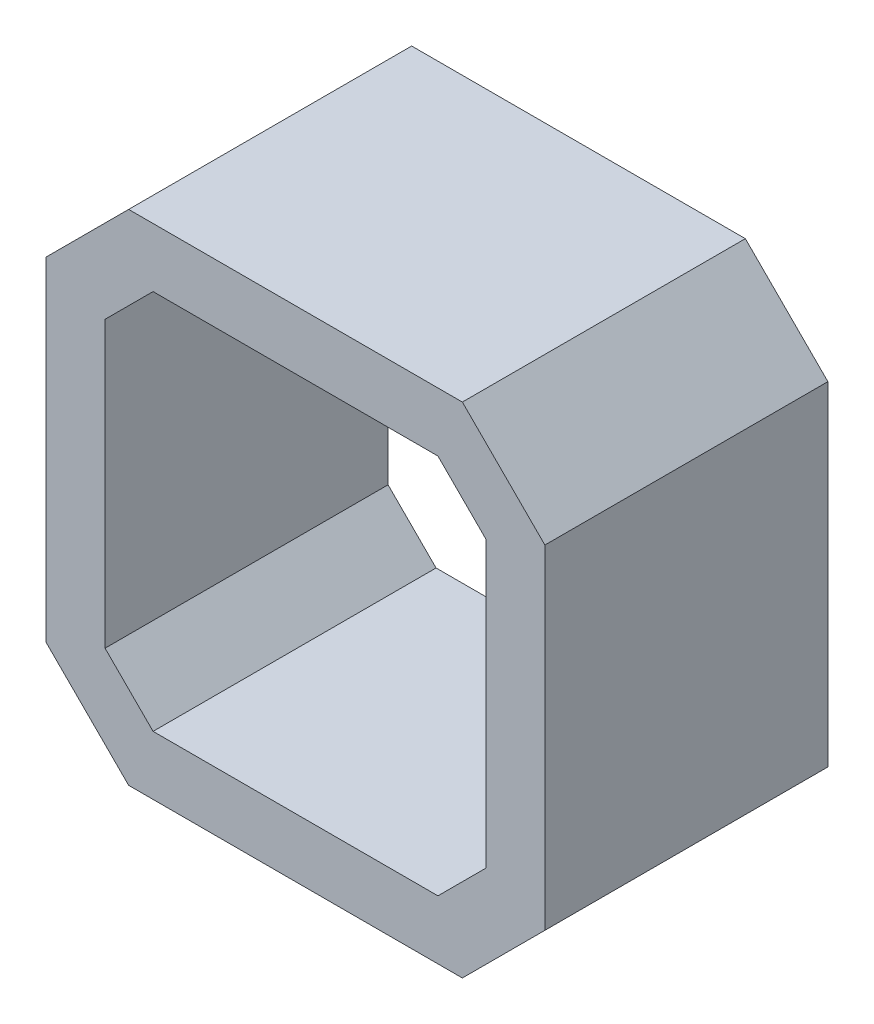
ISO-10303-21;
HEADER;
FILE_DESCRIPTION(('STEP AP214'),'2;1');
FILE_NAME('part.step','',(''),(''),'','','');
FILE_SCHEMA(('AUTOMOTIVE_DESIGN { 1 0 10303 214 1 1 1 1 }'));
ENDSEC;
DATA;
#1=APPLICATION_CONTEXT('core data for automotive mechanical design processes');
#2=APPLICATION_PROTOCOL_DEFINITION('international standard','automotive_design',2000,#1);
#3=PRODUCT_CONTEXT('',#1,'mechanical');
#4=PRODUCT('Part','Part','',(#3));
#5=PRODUCT_RELATED_PRODUCT_CATEGORY('part','',(#4));
#6=PRODUCT_DEFINITION_FORMATION('','',#4);
#7=PRODUCT_DEFINITION_CONTEXT('part definition',#1,'design');
#8=PRODUCT_DEFINITION('design','',#6,#7);
#9=PRODUCT_DEFINITION_SHAPE('','',#8);
#10=(LENGTH_UNIT() NAMED_UNIT(*) SI_UNIT(.MILLI.,.METRE.));
#11=(NAMED_UNIT(*) PLANE_ANGLE_UNIT() SI_UNIT($,.RADIAN.));
#12=(NAMED_UNIT(*) SI_UNIT($,.STERADIAN.) SOLID_ANGLE_UNIT());
#13=UNCERTAINTY_MEASURE_WITH_UNIT(LENGTH_MEASURE(1.E-05),#10,'distance_accuracy_value','');
#14=(GEOMETRIC_REPRESENTATION_CONTEXT(3) GLOBAL_UNCERTAINTY_ASSIGNED_CONTEXT((#13)) GLOBAL_UNIT_ASSIGNED_CONTEXT((#10,
#11,#12)) REPRESENTATION_CONTEXT('',''));
#15=CARTESIAN_POINT('',(0.,0.,0.));
#16=DIRECTION('',(0.,0.,1.));
#17=DIRECTION('',(1.,0.,0.));
#18=AXIS2_PLACEMENT_3D('',#15,#16,#17);
#19=CARTESIAN_POINT('',(0.,0.,48.));
#20=DIRECTION('',(0.,0.,-1.));
#21=DIRECTION('',(-1.,0.,0.));
#22=AXIS2_PLACEMENT_3D('',#19,#20,#21);
#23=PLANE('',#22);
#24=DIRECTION('',(0.,-1.,0.));
#25=VECTOR('',#24,1.);
#26=CARTESIAN_POINT('',(-42.3,-28.3,48.));
#27=LINE('',#26,#25);
#28=CARTESIAN_POINT('',(-42.3,28.3,48.));
#29=VERTEX_POINT('',#28);
#30=CARTESIAN_POINT('',(-42.3,-28.3,48.));
#31=VERTEX_POINT('',#30);
#32=EDGE_CURVE('E212',#29,#31,#27,.T.);
#33=ORIENTED_EDGE('',*,*,#32,.T.);
#34=DIRECTION('',(0.707106781186547,-0.707106781186547,0.));
#35=VECTOR('',#34,1.);
#36=CARTESIAN_POINT('',(-42.3,-28.3,48.));
#37=LINE('',#36,#35);
#38=CARTESIAN_POINT('',(-28.3,-42.3,48.));
#39=VERTEX_POINT('',#38);
#40=EDGE_CURVE('E215',#31,#39,#37,.T.);
#41=ORIENTED_EDGE('',*,*,#40,.T.);
#42=DIRECTION('',(1.,0.,0.));
#43=VECTOR('',#42,1.);
#44=CARTESIAN_POINT('',(-28.3,-42.3,48.));
#45=LINE('',#44,#43);
#46=CARTESIAN_POINT('',(28.3,-42.3,48.));
#47=VERTEX_POINT('',#46);
#48=EDGE_CURVE('E218',#39,#47,#45,.T.);
#49=ORIENTED_EDGE('',*,*,#48,.T.);
#50=DIRECTION('',(0.707106781186547,0.707106781186547,0.));
#51=VECTOR('',#50,1.);
#52=CARTESIAN_POINT('',(28.3,-42.3,48.));
#53=LINE('',#52,#51);
#54=CARTESIAN_POINT('',(42.3,-28.3,48.));
#55=VERTEX_POINT('',#54);
#56=EDGE_CURVE('E220',#47,#55,#53,.T.);
#57=ORIENTED_EDGE('',*,*,#56,.T.);
#58=DIRECTION('',(0.,1.,0.));
#59=VECTOR('',#58,1.);
#60=CARTESIAN_POINT('',(42.3,-28.3,48.));
#61=LINE('',#60,#59);
#62=CARTESIAN_POINT('',(42.3,28.3,48.));
#63=VERTEX_POINT('',#62);
#64=EDGE_CURVE('E222',#55,#63,#61,.T.);
#65=ORIENTED_EDGE('',*,*,#64,.T.);
#66=DIRECTION('',(-0.707106781186547,0.707106781186547,0.));
#67=VECTOR('',#66,1.);
#68=CARTESIAN_POINT('',(28.3,42.3,48.));
#69=LINE('',#68,#67);
#70=CARTESIAN_POINT('',(28.3,42.3,48.));
#71=VERTEX_POINT('',#70);
#72=EDGE_CURVE('E224',#63,#71,#69,.T.);
#73=ORIENTED_EDGE('',*,*,#72,.T.);
#74=DIRECTION('',(-1.,0.,0.));
#75=VECTOR('',#74,1.);
#76=CARTESIAN_POINT('',(-28.3,42.3,48.));
#77=LINE('',#76,#75);
#78=CARTESIAN_POINT('',(-28.3,42.3,48.));
#79=VERTEX_POINT('',#78);
#80=EDGE_CURVE('E226',#71,#79,#77,.T.);
#81=ORIENTED_EDGE('',*,*,#80,.T.);
#82=DIRECTION('',(-0.707106781186547,-0.707106781186547,0.));
#83=VECTOR('',#82,1.);
#84=CARTESIAN_POINT('',(-42.3,28.3,48.));
#85=LINE('',#84,#83);
#86=EDGE_CURVE('E228',#79,#29,#85,.T.);
#87=ORIENTED_EDGE('',*,*,#86,.T.);
#88=EDGE_LOOP('',(#33,#41,#49,#57,#65,#73,#81,#87));
#89=FACE_BOUND('',#88,.T.);
#90=DIRECTION('',(-0.707106781186547,-0.707106781186547,0.));
#91=VECTOR('',#90,1.);
#92=CARTESIAN_POINT('',(-32.3,24.157864376269,48.));
#93=LINE('',#92,#91);
#94=CARTESIAN_POINT('',(-24.157864376269,32.3,48.));
#95=VERTEX_POINT('',#94);
#96=CARTESIAN_POINT('',(-32.3,24.157864376269,48.));
#97=VERTEX_POINT('',#96);
#98=EDGE_CURVE('E147',#95,#97,#93,.T.);
#99=ORIENTED_EDGE('',*,*,#98,.F.);
#100=DIRECTION('',(-1.,0.,0.));
#101=VECTOR('',#100,1.);
#102=CARTESIAN_POINT('',(-24.157864376269,32.3,48.));
#103=LINE('',#102,#101);
#104=CARTESIAN_POINT('',(24.157864376269,32.3,48.));
#105=VERTEX_POINT('',#104);
#106=EDGE_CURVE('E180',#105,#95,#103,.T.);
#107=ORIENTED_EDGE('',*,*,#106,.F.);
#108=DIRECTION('',(-0.707106781186548,0.707106781186547,0.));
#109=VECTOR('',#108,1.);
#110=CARTESIAN_POINT('',(24.157864376269,32.3,48.));
#111=LINE('',#110,#109);
#112=CARTESIAN_POINT('',(32.3,24.1578643762691,48.));
#113=VERTEX_POINT('',#112);
#114=EDGE_CURVE('E178',#113,#105,#111,.T.);
#115=ORIENTED_EDGE('',*,*,#114,.F.);
#116=DIRECTION('',(0.,1.,0.));
#117=VECTOR('',#116,1.);
#118=CARTESIAN_POINT('',(32.3,-24.1578643762691,48.));
#119=LINE('',#118,#117);
#120=CARTESIAN_POINT('',(32.3,-24.1578643762691,48.));
#121=VERTEX_POINT('',#120);
#122=EDGE_CURVE('E176',#121,#113,#119,.T.);
#123=ORIENTED_EDGE('',*,*,#122,.F.);
#124=DIRECTION('',(0.707106781186547,0.707106781186547,0.));
#125=VECTOR('',#124,1.);
#126=CARTESIAN_POINT('',(24.157864376269,-32.3,48.));
#127=LINE('',#126,#125);
#128=CARTESIAN_POINT('',(24.157864376269,-32.3,48.));
#129=VERTEX_POINT('',#128);
#130=EDGE_CURVE('E174',#129,#121,#127,.T.);
#131=ORIENTED_EDGE('',*,*,#130,.F.);
#132=DIRECTION('',(1.,0.,0.));
#133=VECTOR('',#132,1.);
#134=CARTESIAN_POINT('',(-24.157864376269,-32.3,48.));
#135=LINE('',#134,#133);
#136=CARTESIAN_POINT('',(-24.157864376269,-32.3,48.));
#137=VERTEX_POINT('',#136);
#138=EDGE_CURVE('E170',#137,#129,#135,.T.);
#139=ORIENTED_EDGE('',*,*,#138,.F.);
#140=DIRECTION('',(0.707106781186547,-0.707106781186547,0.));
#141=VECTOR('',#140,1.);
#142=CARTESIAN_POINT('',(-32.3,-24.157864376269,48.));
#143=LINE('',#142,#141);
#144=CARTESIAN_POINT('',(-32.3,-24.157864376269,48.));
#145=VERTEX_POINT('',#144);
#146=EDGE_CURVE('E168',#145,#137,#143,.T.);
#147=ORIENTED_EDGE('',*,*,#146,.F.);
#148=DIRECTION('',(0.,-1.,0.));
#149=VECTOR('',#148,1.);
#150=CARTESIAN_POINT('',(-32.3,-24.157864376269,48.));
#151=LINE('',#150,#149);
#152=EDGE_CURVE('E155',#97,#145,#151,.T.);
#153=ORIENTED_EDGE('',*,*,#152,.F.);
#154=EDGE_LOOP('',(#99,#107,#115,#123,#131,#139,#147,#153));
#155=FACE_BOUND('',#154,.T.);
#156=ADVANCED_FACE('F34',(#89,#155),#23,.F.);
#157=CARTESIAN_POINT('',(0.,0.,0.));
#158=DIRECTION('',(0.,0.,-1.));
#159=DIRECTION('',(-1.,0.,0.));
#160=AXIS2_PLACEMENT_3D('',#157,#158,#159);
#161=PLANE('',#160);
#162=DIRECTION('',(0.,-1.,0.));
#163=VECTOR('',#162,1.);
#164=CARTESIAN_POINT('',(-42.3,-28.3,0.));
#165=LINE('',#164,#163);
#166=CARTESIAN_POINT('',(-42.3,28.3,0.));
#167=VERTEX_POINT('',#166);
#168=CARTESIAN_POINT('',(-42.3,-28.3,0.));
#169=VERTEX_POINT('',#168);
#170=EDGE_CURVE('E163',#167,#169,#165,.T.);
#171=ORIENTED_EDGE('',*,*,#170,.F.);
#172=DIRECTION('',(-0.707106781186547,-0.707106781186547,0.));
#173=VECTOR('',#172,1.);
#174=CARTESIAN_POINT('',(-42.3,28.3,0.));
#175=LINE('',#174,#173);
#176=CARTESIAN_POINT('',(-28.3,42.3,0.));
#177=VERTEX_POINT('',#176);
#178=EDGE_CURVE('E216',#177,#167,#175,.T.);
#179=ORIENTED_EDGE('',*,*,#178,.F.);
#180=DIRECTION('',(-1.,0.,0.));
#181=VECTOR('',#180,1.);
#182=CARTESIAN_POINT('',(-28.3,42.3,0.));
#183=LINE('',#182,#181);
#184=CARTESIAN_POINT('',(28.3,42.3,0.));
#185=VERTEX_POINT('',#184);
#186=EDGE_CURVE('E243',#185,#177,#183,.T.);
#187=ORIENTED_EDGE('',*,*,#186,.F.);
#188=DIRECTION('',(-0.707106781186547,0.707106781186547,0.));
#189=VECTOR('',#188,1.);
#190=CARTESIAN_POINT('',(28.3,42.3,0.));
#191=LINE('',#190,#189);
#192=CARTESIAN_POINT('',(42.3,28.3,0.));
#193=VERTEX_POINT('',#192);
#194=EDGE_CURVE('E241',#193,#185,#191,.T.);
#195=ORIENTED_EDGE('',*,*,#194,.F.);
#196=DIRECTION('',(0.,1.,0.));
#197=VECTOR('',#196,1.);
#198=CARTESIAN_POINT('',(42.3,-28.3,0.));
#199=LINE('',#198,#197);
#200=CARTESIAN_POINT('',(42.3,-28.3,0.));
#201=VERTEX_POINT('',#200);
#202=EDGE_CURVE('E239',#201,#193,#199,.T.);
#203=ORIENTED_EDGE('',*,*,#202,.F.);
#204=DIRECTION('',(0.707106781186547,0.707106781186547,0.));
#205=VECTOR('',#204,1.);
#206=CARTESIAN_POINT('',(28.3,-42.3,0.));
#207=LINE('',#206,#205);
#208=CARTESIAN_POINT('',(28.3,-42.3,0.));
#209=VERTEX_POINT('',#208);
#210=EDGE_CURVE('E237',#209,#201,#207,.T.);
#211=ORIENTED_EDGE('',*,*,#210,.F.);
#212=DIRECTION('',(1.,0.,0.));
#213=VECTOR('',#212,1.);
#214=CARTESIAN_POINT('',(-28.3,-42.3,0.));
#215=LINE('',#214,#213);
#216=CARTESIAN_POINT('',(-28.3,-42.3,0.));
#217=VERTEX_POINT('',#216);
#218=EDGE_CURVE('E235',#217,#209,#215,.T.);
#219=ORIENTED_EDGE('',*,*,#218,.F.);
#220=DIRECTION('',(0.707106781186547,-0.707106781186547,0.));
#221=VECTOR('',#220,1.);
#222=CARTESIAN_POINT('',(-42.3,-28.3,0.));
#223=LINE('',#222,#221);
#224=EDGE_CURVE('E233',#169,#217,#223,.T.);
#225=ORIENTED_EDGE('',*,*,#224,.F.);
#226=EDGE_LOOP('',(#171,#179,#187,#195,#203,#211,#219,#225));
#227=FACE_BOUND('',#226,.T.);
#228=DIRECTION('',(-1.,0.,0.));
#229=VECTOR('',#228,1.);
#230=CARTESIAN_POINT('',(-24.157864376269,32.3,0.));
#231=LINE('',#230,#229);
#232=CARTESIAN_POINT('',(24.157864376269,32.3,0.));
#233=VERTEX_POINT('',#232);
#234=CARTESIAN_POINT('',(-24.157864376269,32.3,0.));
#235=VERTEX_POINT('',#234);
#236=EDGE_CURVE('E156',#233,#235,#231,.T.);
#237=ORIENTED_EDGE('',*,*,#236,.T.);
#238=DIRECTION('',(-0.707106781186547,-0.707106781186547,0.));
#239=VECTOR('',#238,1.);
#240=CARTESIAN_POINT('',(-32.3,24.157864376269,0.));
#241=LINE('',#240,#239);
#242=CARTESIAN_POINT('',(-32.3,24.157864376269,0.));
#243=VERTEX_POINT('',#242);
#244=EDGE_CURVE('E57',#235,#243,#241,.T.);
#245=ORIENTED_EDGE('',*,*,#244,.T.);
#246=DIRECTION('',(0.,-1.,0.));
#247=VECTOR('',#246,1.);
#248=CARTESIAN_POINT('',(-32.3,-24.157864376269,0.));
#249=LINE('',#248,#247);
#250=CARTESIAN_POINT('',(-32.3,-24.157864376269,0.));
#251=VERTEX_POINT('',#250);
#252=EDGE_CURVE('E162',#243,#251,#249,.T.);
#253=ORIENTED_EDGE('',*,*,#252,.T.);
#254=DIRECTION('',(0.707106781186547,-0.707106781186547,0.));
#255=VECTOR('',#254,1.);
#256=CARTESIAN_POINT('',(-32.3,-24.157864376269,0.));
#257=LINE('',#256,#255);
#258=CARTESIAN_POINT('',(-24.157864376269,-32.3,0.));
#259=VERTEX_POINT('',#258);
#260=EDGE_CURVE('E184',#251,#259,#257,.T.);
#261=ORIENTED_EDGE('',*,*,#260,.T.);
#262=DIRECTION('',(1.,0.,0.));
#263=VECTOR('',#262,1.);
#264=CARTESIAN_POINT('',(-24.157864376269,-32.3,0.));
#265=LINE('',#264,#263);
#266=CARTESIAN_POINT('',(24.157864376269,-32.3,0.));
#267=VERTEX_POINT('',#266);
#268=EDGE_CURVE('E187',#259,#267,#265,.T.);
#269=ORIENTED_EDGE('',*,*,#268,.T.);
#270=DIRECTION('',(0.707106781186547,0.707106781186547,0.));
#271=VECTOR('',#270,1.);
#272=CARTESIAN_POINT('',(24.157864376269,-32.3,0.));
#273=LINE('',#272,#271);
#274=CARTESIAN_POINT('',(32.3,-24.1578643762691,0.));
#275=VERTEX_POINT('',#274);
#276=EDGE_CURVE('E190',#267,#275,#273,.T.);
#277=ORIENTED_EDGE('',*,*,#276,.T.);
#278=DIRECTION('',(0.,1.,0.));
#279=VECTOR('',#278,1.);
#280=CARTESIAN_POINT('',(32.3,-24.1578643762691,0.));
#281=LINE('',#280,#279);
#282=CARTESIAN_POINT('',(32.3,24.1578643762691,0.));
#283=VERTEX_POINT('',#282);
#284=EDGE_CURVE('E193',#275,#283,#281,.T.);
#285=ORIENTED_EDGE('',*,*,#284,.T.);
#286=DIRECTION('',(-0.707106781186548,0.707106781186547,0.));
#287=VECTOR('',#286,1.);
#288=CARTESIAN_POINT('',(24.157864376269,32.3,0.));
#289=LINE('',#288,#287);
#290=EDGE_CURVE('E196',#283,#233,#289,.T.);
#291=ORIENTED_EDGE('',*,*,#290,.T.);
#292=EDGE_LOOP('',(#237,#245,#253,#261,#269,#277,#285,#291));
#293=FACE_BOUND('',#292,.T.);
#294=ADVANCED_FACE('F273',(#227,#293),#161,.T.);
#295=CARTESIAN_POINT('',(-42.3,-28.3,48.));
#296=DIRECTION('',(1.,0.,0.));
#297=DIRECTION('',(0.,1.,0.));
#298=AXIS2_PLACEMENT_3D('',#295,#296,#297);
#299=PLANE('',#298);
#300=ORIENTED_EDGE('',*,*,#170,.T.);
#301=DIRECTION('',(0.,0.,-1.));
#302=VECTOR('',#301,1.);
#303=CARTESIAN_POINT('',(-42.3,-28.3,48.));
#304=LINE('',#303,#302);
#305=EDGE_CURVE('E11',#31,#169,#304,.T.);
#306=ORIENTED_EDGE('',*,*,#305,.F.);
#307=ORIENTED_EDGE('',*,*,#32,.F.);
#308=DIRECTION('',(0.,0.,-1.));
#309=VECTOR('',#308,1.);
#310=CARTESIAN_POINT('',(-42.3,28.3,48.));
#311=LINE('',#310,#309);
#312=EDGE_CURVE('E230',#29,#167,#311,.T.);
#313=ORIENTED_EDGE('',*,*,#312,.T.);
#314=EDGE_LOOP('',(#300,#306,#307,#313));
#315=FACE_BOUND('',#314,.T.);
#316=ADVANCED_FACE('F36',(#315),#299,.F.);
#317=CARTESIAN_POINT('',(-42.3,-28.3,48.));
#318=DIRECTION('',(0.707106781186548,0.707106781186548,0.));
#319=DIRECTION('',(-0.707106781186548,0.707106781186548,0.));
#320=AXIS2_PLACEMENT_3D('',#317,#318,#319);
#321=PLANE('',#320);
#322=ORIENTED_EDGE('',*,*,#224,.T.);
#323=DIRECTION('',(0.,0.,-1.));
#324=VECTOR('',#323,1.);
#325=CARTESIAN_POINT('',(-28.3,-42.3,48.));
#326=LINE('',#325,#324);
#327=EDGE_CURVE('E42',#39,#217,#326,.T.);
#328=ORIENTED_EDGE('',*,*,#327,.F.);
#329=ORIENTED_EDGE('',*,*,#40,.F.);
#330=ORIENTED_EDGE('',*,*,#305,.T.);
#331=EDGE_LOOP('',(#322,#328,#329,#330));
#332=FACE_BOUND('',#331,.T.);
#333=ADVANCED_FACE('F290',(#332),#321,.F.);
#334=CARTESIAN_POINT('',(-28.3,-42.3,48.));
#335=DIRECTION('',(0.,1.,0.));
#336=DIRECTION('',(-1.,0.,0.));
#337=AXIS2_PLACEMENT_3D('',#334,#335,#336);
#338=PLANE('',#337);
#339=ORIENTED_EDGE('',*,*,#218,.T.);
#340=DIRECTION('',(0.,0.,-1.));
#341=VECTOR('',#340,1.);
#342=CARTESIAN_POINT('',(28.3,-42.3,48.));
#343=LINE('',#342,#341);
#344=EDGE_CURVE('E260',#47,#209,#343,.T.);
#345=ORIENTED_EDGE('',*,*,#344,.F.);
#346=ORIENTED_EDGE('',*,*,#48,.F.);
#347=ORIENTED_EDGE('',*,*,#327,.T.);
#348=EDGE_LOOP('',(#339,#345,#346,#347));
#349=FACE_BOUND('',#348,.T.);
#350=ADVANCED_FACE('F267',(#349),#338,.F.);
#351=CARTESIAN_POINT('',(28.3,-42.3,48.));
#352=DIRECTION('',(-0.707106781186548,0.707106781186548,0.));
#353=DIRECTION('',(-0.707106781186548,-0.707106781186548,0.));
#354=AXIS2_PLACEMENT_3D('',#351,#352,#353);
#355=PLANE('',#354);
#356=ORIENTED_EDGE('',*,*,#210,.T.);
#357=DIRECTION('',(0.,0.,-1.));
#358=VECTOR('',#357,1.);
#359=CARTESIAN_POINT('',(42.3,-28.3,48.));
#360=LINE('',#359,#358);
#361=EDGE_CURVE('E257',#55,#201,#360,.T.);
#362=ORIENTED_EDGE('',*,*,#361,.F.);
#363=ORIENTED_EDGE('',*,*,#56,.F.);
#364=ORIENTED_EDGE('',*,*,#344,.T.);
#365=EDGE_LOOP('',(#356,#362,#363,#364));
#366=FACE_BOUND('',#365,.T.);
#367=ADVANCED_FACE('F279',(#366),#355,.F.);
#368=CARTESIAN_POINT('',(42.3,-28.3,48.));
#369=DIRECTION('',(-1.,0.,0.));
#370=DIRECTION('',(0.,-1.,0.));
#371=AXIS2_PLACEMENT_3D('',#368,#369,#370);
#372=PLANE('',#371);
#373=ORIENTED_EDGE('',*,*,#202,.T.);
#374=DIRECTION('',(0.,0.,-1.));
#375=VECTOR('',#374,1.);
#376=CARTESIAN_POINT('',(42.3,28.3,48.));
#377=LINE('',#376,#375);
#378=EDGE_CURVE('E254',#63,#193,#377,.T.);
#379=ORIENTED_EDGE('',*,*,#378,.F.);
#380=ORIENTED_EDGE('',*,*,#64,.F.);
#381=ORIENTED_EDGE('',*,*,#361,.T.);
#382=EDGE_LOOP('',(#373,#379,#380,#381));
#383=FACE_BOUND('',#382,.T.);
#384=ADVANCED_FACE('F283',(#383),#372,.F.);
#385=CARTESIAN_POINT('',(28.3,42.3,48.));
#386=DIRECTION('',(-0.707106781186548,-0.707106781186548,0.));
#387=DIRECTION('',(0.707106781186548,-0.707106781186548,0.));
#388=AXIS2_PLACEMENT_3D('',#385,#386,#387);
#389=PLANE('',#388);
#390=ORIENTED_EDGE('',*,*,#194,.T.);
#391=DIRECTION('',(0.,0.,-1.));
#392=VECTOR('',#391,1.);
#393=CARTESIAN_POINT('',(28.3,42.3,48.));
#394=LINE('',#393,#392);
#395=EDGE_CURVE('E251',#71,#185,#394,.T.);
#396=ORIENTED_EDGE('',*,*,#395,.F.);
#397=ORIENTED_EDGE('',*,*,#72,.F.);
#398=ORIENTED_EDGE('',*,*,#378,.T.);
#399=EDGE_LOOP('',(#390,#396,#397,#398));
#400=FACE_BOUND('',#399,.T.);
#401=ADVANCED_FACE('F303',(#400),#389,.F.);
#402=CARTESIAN_POINT('',(-28.3,42.3,48.));
#403=DIRECTION('',(0.,-1.,0.));
#404=DIRECTION('',(1.,0.,0.));
#405=AXIS2_PLACEMENT_3D('',#402,#403,#404);
#406=PLANE('',#405);
#407=ORIENTED_EDGE('',*,*,#186,.T.);
#408=DIRECTION('',(0.,0.,-1.));
#409=VECTOR('',#408,1.);
#410=CARTESIAN_POINT('',(-28.3,42.3,48.));
#411=LINE('',#410,#409);
#412=EDGE_CURVE('E248',#79,#177,#411,.T.);
#413=ORIENTED_EDGE('',*,*,#412,.F.);
#414=ORIENTED_EDGE('',*,*,#80,.F.);
#415=ORIENTED_EDGE('',*,*,#395,.T.);
#416=EDGE_LOOP('',(#407,#413,#414,#415));
#417=FACE_BOUND('',#416,.T.);
#418=ADVANCED_FACE('F301',(#417),#406,.F.);
#419=CARTESIAN_POINT('',(-42.3,28.3,48.));
#420=DIRECTION('',(0.707106781186548,-0.707106781186548,0.));
#421=DIRECTION('',(0.707106781186548,0.707106781186548,0.));
#422=AXIS2_PLACEMENT_3D('',#419,#420,#421);
#423=PLANE('',#422);
#424=ORIENTED_EDGE('',*,*,#178,.T.);
#425=ORIENTED_EDGE('',*,*,#312,.F.);
#426=ORIENTED_EDGE('',*,*,#86,.F.);
#427=ORIENTED_EDGE('',*,*,#412,.T.);
#428=EDGE_LOOP('',(#424,#425,#426,#427));
#429=FACE_BOUND('',#428,.T.);
#430=ADVANCED_FACE('F296',(#429),#423,.F.);
#431=CARTESIAN_POINT('',(-32.3,24.157864376269,48.));
#432=DIRECTION('',(0.707106781186548,-0.707106781186548,0.));
#433=DIRECTION('',(0.707106781186548,0.707106781186548,0.));
#434=AXIS2_PLACEMENT_3D('',#431,#432,#433);
#435=PLANE('',#434);
#436=ORIENTED_EDGE('',*,*,#244,.F.);
#437=DIRECTION('',(0.,0.,-1.));
#438=VECTOR('',#437,1.);
#439=CARTESIAN_POINT('',(-24.157864376269,32.3,48.));
#440=LINE('',#439,#438);
#441=EDGE_CURVE('E151',#95,#235,#440,.T.);
#442=ORIENTED_EDGE('',*,*,#441,.F.);
#443=ORIENTED_EDGE('',*,*,#98,.T.);
#444=DIRECTION('',(0.,0.,-1.));
#445=VECTOR('',#444,1.);
#446=CARTESIAN_POINT('',(-32.3,24.157864376269,48.));
#447=LINE('',#446,#445);
#448=EDGE_CURVE('E150',#97,#243,#447,.T.);
#449=ORIENTED_EDGE('',*,*,#448,.T.);
#450=EDGE_LOOP('',(#436,#442,#443,#449));
#451=FACE_BOUND('',#450,.T.);
#452=ADVANCED_FACE('F149',(#451),#435,.T.);
#453=CARTESIAN_POINT('',(-32.3,-24.157864376269,48.));
#454=DIRECTION('',(1.,0.,0.));
#455=DIRECTION('',(0.,1.,0.));
#456=AXIS2_PLACEMENT_3D('',#453,#454,#455);
#457=PLANE('',#456);
#458=ORIENTED_EDGE('',*,*,#252,.F.);
#459=ORIENTED_EDGE('',*,*,#448,.F.);
#460=ORIENTED_EDGE('',*,*,#152,.T.);
#461=DIRECTION('',(0.,0.,-1.));
#462=VECTOR('',#461,1.);
#463=CARTESIAN_POINT('',(-32.3,-24.157864376269,48.));
#464=LINE('',#463,#462);
#465=EDGE_CURVE('E164',#145,#251,#464,.T.);
#466=ORIENTED_EDGE('',*,*,#465,.T.);
#467=EDGE_LOOP('',(#458,#459,#460,#466));
#468=FACE_BOUND('',#467,.T.);
#469=ADVANCED_FACE('F159',(#468),#457,.T.);
#470=CARTESIAN_POINT('',(-32.3,-24.157864376269,48.));
#471=DIRECTION('',(0.707106781186548,0.707106781186548,0.));
#472=DIRECTION('',(-0.707106781186548,0.707106781186548,0.));
#473=AXIS2_PLACEMENT_3D('',#470,#471,#472);
#474=PLANE('',#473);
#475=ORIENTED_EDGE('',*,*,#260,.F.);
#476=ORIENTED_EDGE('',*,*,#465,.F.);
#477=ORIENTED_EDGE('',*,*,#146,.T.);
#478=DIRECTION('',(0.,0.,-1.));
#479=VECTOR('',#478,1.);
#480=CARTESIAN_POINT('',(-24.157864376269,-32.3,48.));
#481=LINE('',#480,#479);
#482=EDGE_CURVE('E209',#137,#259,#481,.T.);
#483=ORIENTED_EDGE('',*,*,#482,.T.);
#484=EDGE_LOOP('',(#475,#476,#477,#483));
#485=FACE_BOUND('',#484,.T.);
#486=ADVANCED_FACE('F328',(#485),#474,.T.);
#487=CARTESIAN_POINT('',(-24.157864376269,-32.3,48.));
#488=DIRECTION('',(0.,1.,0.));
#489=DIRECTION('',(-1.,0.,0.));
#490=AXIS2_PLACEMENT_3D('',#487,#488,#489);
#491=PLANE('',#490);
#492=ORIENTED_EDGE('',*,*,#268,.F.);
#493=ORIENTED_EDGE('',*,*,#482,.F.);
#494=ORIENTED_EDGE('',*,*,#138,.T.);
#495=DIRECTION('',(0.,0.,-1.));
#496=VECTOR('',#495,1.);
#497=CARTESIAN_POINT('',(24.157864376269,-32.3,48.));
#498=LINE('',#497,#496);
#499=EDGE_CURVE('E207',#129,#267,#498,.T.);
#500=ORIENTED_EDGE('',*,*,#499,.T.);
#501=EDGE_LOOP('',(#492,#493,#494,#500));
#502=FACE_BOUND('',#501,.T.);
#503=ADVANCED_FACE('F332',(#502),#491,.T.);
#504=CARTESIAN_POINT('',(24.157864376269,-32.3,48.));
#505=DIRECTION('',(-0.707106781186548,0.707106781186548,0.));
#506=DIRECTION('',(-0.707106781186548,-0.707106781186548,0.));
#507=AXIS2_PLACEMENT_3D('',#504,#505,#506);
#508=PLANE('',#507);
#509=ORIENTED_EDGE('',*,*,#276,.F.);
#510=ORIENTED_EDGE('',*,*,#499,.F.);
#511=ORIENTED_EDGE('',*,*,#130,.T.);
#512=DIRECTION('',(0.,0.,-1.));
#513=VECTOR('',#512,1.);
#514=CARTESIAN_POINT('',(32.3,-24.1578643762691,48.));
#515=LINE('',#514,#513);
#516=EDGE_CURVE('E205',#121,#275,#515,.T.);
#517=ORIENTED_EDGE('',*,*,#516,.T.);
#518=EDGE_LOOP('',(#509,#510,#511,#517));
#519=FACE_BOUND('',#518,.T.);
#520=ADVANCED_FACE('F338',(#519),#508,.T.);
#521=CARTESIAN_POINT('',(32.3,-24.1578643762691,48.));
#522=DIRECTION('',(-1.,0.,0.));
#523=DIRECTION('',(0.,-1.,0.));
#524=AXIS2_PLACEMENT_3D('',#521,#522,#523);
#525=PLANE('',#524);
#526=ORIENTED_EDGE('',*,*,#284,.F.);
#527=ORIENTED_EDGE('',*,*,#516,.F.);
#528=ORIENTED_EDGE('',*,*,#122,.T.);
#529=DIRECTION('',(0.,0.,-1.));
#530=VECTOR('',#529,1.);
#531=CARTESIAN_POINT('',(32.3,24.1578643762691,48.));
#532=LINE('',#531,#530);
#533=EDGE_CURVE('E203',#113,#283,#532,.T.);
#534=ORIENTED_EDGE('',*,*,#533,.T.);
#535=EDGE_LOOP('',(#526,#527,#528,#534));
#536=FACE_BOUND('',#535,.T.);
#537=ADVANCED_FACE('F342',(#536),#525,.T.);
#538=CARTESIAN_POINT('',(24.157864376269,32.3,48.));
#539=DIRECTION('',(-0.707106781186547,-0.707106781186548,0.));
#540=DIRECTION('',(0.707106781186548,-0.707106781186547,0.));
#541=AXIS2_PLACEMENT_3D('',#538,#539,#540);
#542=PLANE('',#541);
#543=ORIENTED_EDGE('',*,*,#290,.F.);
#544=ORIENTED_EDGE('',*,*,#533,.F.);
#545=ORIENTED_EDGE('',*,*,#114,.T.);
#546=DIRECTION('',(0.,0.,-1.));
#547=VECTOR('',#546,1.);
#548=CARTESIAN_POINT('',(24.157864376269,32.3,48.));
#549=LINE('',#548,#547);
#550=EDGE_CURVE('E49',#105,#233,#549,.T.);
#551=ORIENTED_EDGE('',*,*,#550,.T.);
#552=EDGE_LOOP('',(#543,#544,#545,#551));
#553=FACE_BOUND('',#552,.T.);
#554=ADVANCED_FACE('F346',(#553),#542,.T.);
#555=CARTESIAN_POINT('',(-24.157864376269,32.3,48.));
#556=DIRECTION('',(0.,-1.,0.));
#557=DIRECTION('',(1.,0.,0.));
#558=AXIS2_PLACEMENT_3D('',#555,#556,#557);
#559=PLANE('',#558);
#560=ORIENTED_EDGE('',*,*,#236,.F.);
#561=ORIENTED_EDGE('',*,*,#550,.F.);
#562=ORIENTED_EDGE('',*,*,#106,.T.);
#563=ORIENTED_EDGE('',*,*,#441,.T.);
#564=EDGE_LOOP('',(#560,#561,#562,#563));
#565=FACE_BOUND('',#564,.T.);
#566=ADVANCED_FACE('F350',(#565),#559,.T.);
#567=CLOSED_SHELL('',(#156,#294,#316,#333,#350,#367,#384,#401,#418,#430,#452,#469,#486,#503,
#520,#537,#554,#566));
#568=MANIFOLD_SOLID_BREP('B2',#567);
#569=ADVANCED_BREP_SHAPE_REPRESENTATION('',(#18,#568),#14);
#570=SHAPE_DEFINITION_REPRESENTATION(#9,#569);
ENDSEC;
END-ISO-10303-21;
